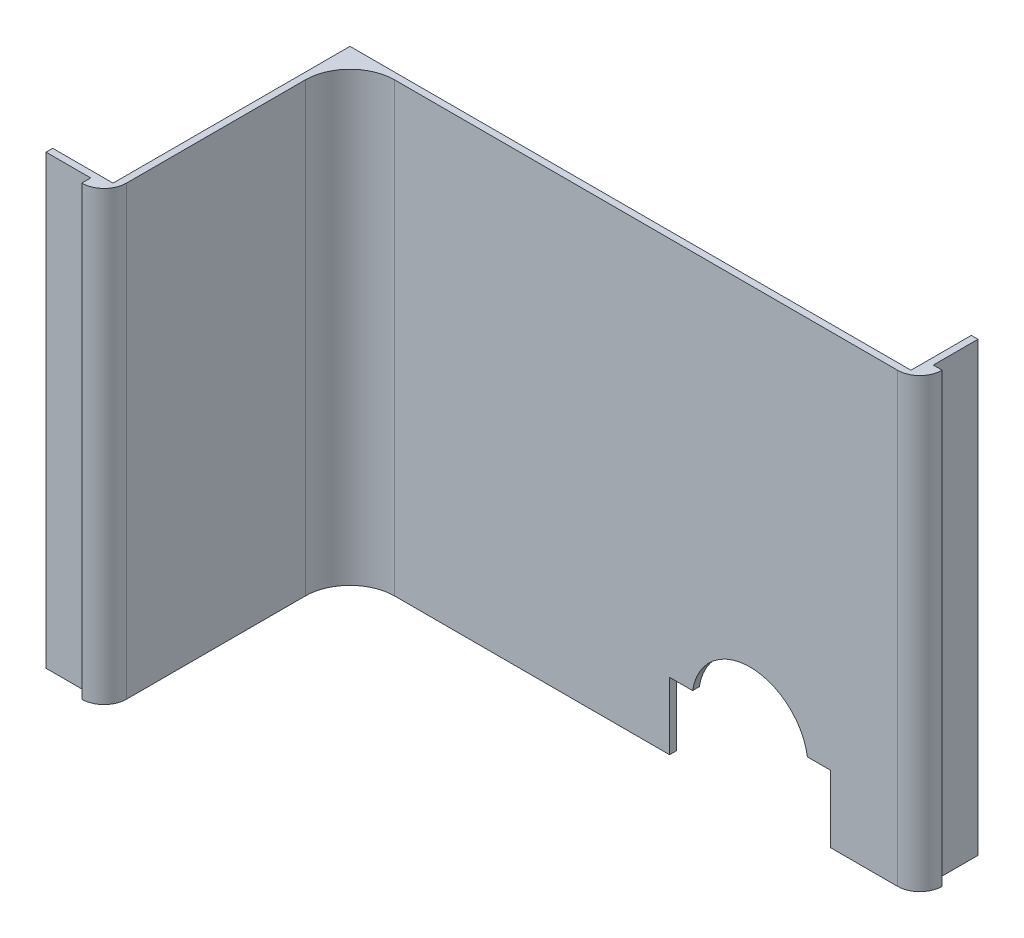
ISO-10303-21;
HEADER;
FILE_DESCRIPTION(('STEP AP214'),'2;1');
FILE_NAME('part.step','',(''),(''),'','','');
FILE_SCHEMA(('AUTOMOTIVE_DESIGN { 1 0 10303 214 1 1 1 1 }'));
ENDSEC;
DATA;
#1=APPLICATION_CONTEXT('core data for automotive mechanical design processes');
#2=APPLICATION_PROTOCOL_DEFINITION('international standard','automotive_design',2000,#1);
#3=PRODUCT_CONTEXT('',#1,'mechanical');
#4=PRODUCT('Part','Part','',(#3));
#5=PRODUCT_RELATED_PRODUCT_CATEGORY('part','',(#4));
#6=PRODUCT_DEFINITION_FORMATION('','',#4);
#7=PRODUCT_DEFINITION_CONTEXT('part definition',#1,'design');
#8=PRODUCT_DEFINITION('design','',#6,#7);
#9=PRODUCT_DEFINITION_SHAPE('','',#8);
#10=(LENGTH_UNIT() NAMED_UNIT(*) SI_UNIT(.MILLI.,.METRE.));
#11=(NAMED_UNIT(*) PLANE_ANGLE_UNIT() SI_UNIT($,.RADIAN.));
#12=(NAMED_UNIT(*) SI_UNIT($,.STERADIAN.) SOLID_ANGLE_UNIT());
#13=UNCERTAINTY_MEASURE_WITH_UNIT(LENGTH_MEASURE(1.E-05),#10,'distance_accuracy_value','');
#14=(GEOMETRIC_REPRESENTATION_CONTEXT(3) GLOBAL_UNCERTAINTY_ASSIGNED_CONTEXT((#13)) GLOBAL_UNIT_ASSIGNED_CONTEXT((#10,
#11,#12)) REPRESENTATION_CONTEXT('',''));
#15=CARTESIAN_POINT('',(0.,0.,0.));
#16=DIRECTION('',(0.,0.,1.));
#17=DIRECTION('',(1.,0.,0.));
#18=AXIS2_PLACEMENT_3D('',#15,#16,#17);
#19=CARTESIAN_POINT('',(0.,0.,-5.));
#20=DIRECTION('',(0.,1.,0.));
#21=DIRECTION('',(0.,0.,1.));
#22=AXIS2_PLACEMENT_3D('',#19,#20,#21);
#23=PLANE('',#22);
#24=DIRECTION('',(1.,0.,0.));
#25=VECTOR('',#24,1.);
#26=CARTESIAN_POINT('',(0.,0.,0.));
#27=LINE('',#26,#25);
#28=CARTESIAN_POINT('',(-15.,0.,0.));
#29=VERTEX_POINT('',#28);
#30=CARTESIAN_POINT('',(0.,0.,0.));
#31=VERTEX_POINT('',#30);
#32=EDGE_CURVE('E112',#29,#31,#27,.T.);
#33=ORIENTED_EDGE('',*,*,#32,.F.);
#34=DIRECTION('',(0.,0.,-1.));
#35=VECTOR('',#34,1.);
#36=CARTESIAN_POINT('',(-15.,0.,-5.));
#37=LINE('',#36,#35);
#38=CARTESIAN_POINT('',(-15.,0.,-1.5));
#39=VERTEX_POINT('',#38);
#40=EDGE_CURVE('E11',#29,#39,#37,.T.);
#41=ORIENTED_EDGE('',*,*,#40,.T.);
#42=DIRECTION('',(-1.,0.,0.));
#43=VECTOR('',#42,1.);
#44=CARTESIAN_POINT('',(-124.,0.,-1.49999999999999));
#45=LINE('',#44,#43);
#46=CARTESIAN_POINT('',(1.5,0.,-1.5));
#47=VERTEX_POINT('',#46);
#48=EDGE_CURVE('E199',#47,#39,#45,.T.);
#49=ORIENTED_EDGE('',*,*,#48,.F.);
#50=DIRECTION('',(0.,0.,1.));
#51=VECTOR('',#50,1.);
#52=CARTESIAN_POINT('',(1.5,0.,-15.));
#53=LINE('',#52,#51);
#54=CARTESIAN_POINT('',(1.5,0.,-15.));
#55=VERTEX_POINT('',#54);
#56=EDGE_CURVE('E196',#55,#47,#53,.T.);
#57=ORIENTED_EDGE('',*,*,#56,.F.);
#58=DIRECTION('',(-1.,0.,0.));
#59=VECTOR('',#58,1.);
#60=CARTESIAN_POINT('',(3.,0.,-15.));
#61=LINE('',#60,#59);
#62=CARTESIAN_POINT('',(3.,0.,-15.));
#63=VERTEX_POINT('',#62);
#64=EDGE_CURVE('E194',#63,#55,#61,.T.);
#65=ORIENTED_EDGE('',*,*,#64,.F.);
#66=DIRECTION('',(0.,0.,-1.));
#67=VECTOR('',#66,1.);
#68=CARTESIAN_POINT('',(3.,0.,-5.));
#69=LINE('',#68,#67);
#70=CARTESIAN_POINT('',(3.,0.,-5.));
#71=VERTEX_POINT('',#70);
#72=EDGE_CURVE('E192',#71,#63,#69,.T.);
#73=ORIENTED_EDGE('',*,*,#72,.F.);
#74=DIRECTION('',(-1.,0.,0.));
#75=VECTOR('',#74,1.);
#76=CARTESIAN_POINT('',(5.,0.,-5.));
#77=LINE('',#76,#75);
#78=CARTESIAN_POINT('',(5.,0.,-5.));
#79=VERTEX_POINT('',#78);
#80=EDGE_CURVE('E189',#79,#71,#77,.T.);
#81=ORIENTED_EDGE('',*,*,#80,.F.);
#82=CARTESIAN_POINT('',(0.,0.,-5.));
#83=DIRECTION('',(0.,1.,0.));
#84=DIRECTION('',(0.,0.,1.));
#85=AXIS2_PLACEMENT_3D('',#82,#83,#84);
#86=CIRCLE('',#85,5.);
#87=EDGE_CURVE('E186',#31,#79,#86,.T.);
#88=ORIENTED_EDGE('',*,*,#87,.F.);
#89=EDGE_LOOP('',(#33,#41,#49,#57,#65,#73,#81,#88));
#90=FACE_BOUND('',#89,.T.);
#91=ADVANCED_FACE('F34',(#90),#23,.F.);
#92=CARTESIAN_POINT('',(0.,100.,-5.));
#93=DIRECTION('',(0.,-1.,0.));
#94=DIRECTION('',(0.,0.,-1.));
#95=AXIS2_PLACEMENT_3D('',#92,#93,#94);
#96=CYLINDRICAL_SURFACE('',#95,5.);
#97=ORIENTED_EDGE('',*,*,#87,.T.);
#98=DIRECTION('',(0.,-1.,0.));
#99=VECTOR('',#98,1.);
#100=CARTESIAN_POINT('',(5.,100.,-5.));
#101=LINE('',#100,#99);
#102=CARTESIAN_POINT('',(5.,100.,-5.));
#103=VERTEX_POINT('',#102);
#104=EDGE_CURVE('E254',#103,#79,#101,.T.);
#105=ORIENTED_EDGE('',*,*,#104,.F.);
#106=CARTESIAN_POINT('',(0.,100.,-5.));
#107=DIRECTION('',(0.,1.,0.));
#108=DIRECTION('',(0.,0.,1.));
#109=AXIS2_PLACEMENT_3D('',#106,#107,#108);
#110=CIRCLE('',#109,5.);
#111=CARTESIAN_POINT('',(0.,100.,0.));
#112=VERTEX_POINT('',#111);
#113=EDGE_CURVE('E220',#112,#103,#110,.T.);
#114=ORIENTED_EDGE('',*,*,#113,.F.);
#115=DIRECTION('',(0.,-1.,0.));
#116=VECTOR('',#115,1.);
#117=CARTESIAN_POINT('',(0.,100.,0.));
#118=LINE('',#117,#116);
#119=EDGE_CURVE('E182',#112,#31,#118,.T.);
#120=ORIENTED_EDGE('',*,*,#119,.T.);
#121=EDGE_LOOP('',(#97,#105,#114,#120));
#122=FACE_BOUND('',#121,.T.);
#123=ADVANCED_FACE('F36',(#122),#96,.T.);
#124=CARTESIAN_POINT('',(5.,100.,-5.));
#125=DIRECTION('',(0.,0.,1.));
#126=DIRECTION('',(1.,0.,0.));
#127=AXIS2_PLACEMENT_3D('',#124,#125,#126);
#128=PLANE('',#127);
#129=ORIENTED_EDGE('',*,*,#80,.T.);
#130=DIRECTION('',(0.,-1.,0.));
#131=VECTOR('',#130,1.);
#132=CARTESIAN_POINT('',(3.,100.,-5.));
#133=LINE('',#132,#131);
#134=CARTESIAN_POINT('',(3.,100.,-5.));
#135=VERTEX_POINT('',#134);
#136=EDGE_CURVE('E251',#135,#71,#133,.T.);
#137=ORIENTED_EDGE('',*,*,#136,.F.);
#138=DIRECTION('',(-1.,0.,0.));
#139=VECTOR('',#138,1.);
#140=CARTESIAN_POINT('',(5.,100.,-5.));
#141=LINE('',#140,#139);
#142=EDGE_CURVE('E121',#103,#135,#141,.T.);
#143=ORIENTED_EDGE('',*,*,#142,.F.);
#144=ORIENTED_EDGE('',*,*,#104,.T.);
#145=EDGE_LOOP('',(#129,#137,#143,#144));
#146=FACE_BOUND('',#145,.T.);
#147=ADVANCED_FACE('F410',(#146),#128,.F.);
#148=CARTESIAN_POINT('',(3.,100.,-5.));
#149=DIRECTION('',(-1.,0.,0.));
#150=DIRECTION('',(0.,0.,1.));
#151=AXIS2_PLACEMENT_3D('',#148,#149,#150);
#152=PLANE('',#151);
#153=ORIENTED_EDGE('',*,*,#72,.T.);
#154=DIRECTION('',(0.,-1.,0.));
#155=VECTOR('',#154,1.);
#156=CARTESIAN_POINT('',(3.,100.,-15.));
#157=LINE('',#156,#155);
#158=CARTESIAN_POINT('',(3.,100.,-15.));
#159=VERTEX_POINT('',#158);
#160=EDGE_CURVE('E248',#159,#63,#157,.T.);
#161=ORIENTED_EDGE('',*,*,#160,.F.);
#162=DIRECTION('',(0.,0.,-1.));
#163=VECTOR('',#162,1.);
#164=CARTESIAN_POINT('',(3.,100.,-5.));
#165=LINE('',#164,#163);
#166=EDGE_CURVE('E272',#135,#159,#165,.T.);
#167=ORIENTED_EDGE('',*,*,#166,.F.);
#168=ORIENTED_EDGE('',*,*,#136,.T.);
#169=EDGE_LOOP('',(#153,#161,#167,#168));
#170=FACE_BOUND('',#169,.T.);
#171=ADVANCED_FACE('F409',(#170),#152,.F.);
#172=CARTESIAN_POINT('',(3.,100.,-15.));
#173=DIRECTION('',(0.,0.,1.));
#174=DIRECTION('',(1.,0.,0.));
#175=AXIS2_PLACEMENT_3D('',#172,#173,#174);
#176=PLANE('',#175);
#177=ORIENTED_EDGE('',*,*,#64,.T.);
#178=DIRECTION('',(0.,-1.,0.));
#179=VECTOR('',#178,1.);
#180=CARTESIAN_POINT('',(1.5,100.,-15.));
#181=LINE('',#180,#179);
#182=CARTESIAN_POINT('',(1.5,100.,-15.));
#183=VERTEX_POINT('',#182);
#184=EDGE_CURVE('E245',#183,#55,#181,.T.);
#185=ORIENTED_EDGE('',*,*,#184,.F.);
#186=DIRECTION('',(-1.,0.,0.));
#187=VECTOR('',#186,1.);
#188=CARTESIAN_POINT('',(3.,100.,-15.));
#189=LINE('',#188,#187);
#190=EDGE_CURVE('E278',#159,#183,#189,.T.);
#191=ORIENTED_EDGE('',*,*,#190,.F.);
#192=ORIENTED_EDGE('',*,*,#160,.T.);
#193=EDGE_LOOP('',(#177,#185,#191,#192));
#194=FACE_BOUND('',#193,.T.);
#195=ADVANCED_FACE('F404',(#194),#176,.F.);
#196=CARTESIAN_POINT('',(1.5,100.,-15.));
#197=DIRECTION('',(1.,0.,0.));
#198=DIRECTION('',(0.,0.,-1.));
#199=AXIS2_PLACEMENT_3D('',#196,#197,#198);
#200=PLANE('',#199);
#201=ORIENTED_EDGE('',*,*,#56,.T.);
#202=DIRECTION('',(0.,-1.,0.));
#203=VECTOR('',#202,1.);
#204=CARTESIAN_POINT('',(1.5,100.,-1.5));
#205=LINE('',#204,#203);
#206=CARTESIAN_POINT('',(1.5,100.,-1.5));
#207=VERTEX_POINT('',#206);
#208=EDGE_CURVE('E242',#207,#47,#205,.T.);
#209=ORIENTED_EDGE('',*,*,#208,.F.);
#210=DIRECTION('',(0.,0.,1.));
#211=VECTOR('',#210,1.);
#212=CARTESIAN_POINT('',(1.5,100.,-15.));
#213=LINE('',#212,#211);
#214=EDGE_CURVE('E280',#183,#207,#213,.T.);
#215=ORIENTED_EDGE('',*,*,#214,.F.);
#216=ORIENTED_EDGE('',*,*,#184,.T.);
#217=EDGE_LOOP('',(#201,#209,#215,#216));
#218=FACE_BOUND('',#217,.T.);
#219=ADVANCED_FACE('F399',(#218),#200,.F.);
#220=CARTESIAN_POINT('',(-124.,100.,-1.49999999999999));
#221=DIRECTION('',(0.,0.,1.));
#222=DIRECTION('',(1.,0.,0.));
#223=AXIS2_PLACEMENT_3D('',#220,#221,#222);
#224=PLANE('',#223);
#225=ORIENTED_EDGE('',*,*,#48,.T.);
#226=DIRECTION('',(0.,1.,0.));
#227=VECTOR('',#226,1.);
#228=CARTESIAN_POINT('',(-15.,100.,-1.5));
#229=LINE('',#228,#227);
#230=CARTESIAN_POINT('',(-15.,14.9971928806068,-1.5));
#231=VERTEX_POINT('',#230);
#232=EDGE_CURVE('E332',#39,#231,#229,.T.);
#233=ORIENTED_EDGE('',*,*,#232,.T.);
#234=DIRECTION('',(-1.,0.,0.));
#235=VECTOR('',#234,1.);
#236=CARTESIAN_POINT('',(-124.,14.9971928806068,-1.49999999999999));
#237=LINE('',#236,#235);
#238=CARTESIAN_POINT('',(-20.1543306675886,14.9971928806068,-1.5));
#239=VERTEX_POINT('',#238);
#240=EDGE_CURVE('E336',#231,#239,#237,.T.);
#241=ORIENTED_EDGE('',*,*,#240,.T.);
#242=CARTESIAN_POINT('',(-33.,13.,-1.5));
#243=DIRECTION('',(0.,0.,1.));
#244=DIRECTION('',(1.,0.,0.));
#245=AXIS2_PLACEMENT_3D('',#242,#243,#244);
#246=CIRCLE('',#245,13.);
#247=CARTESIAN_POINT('',(-45.8452325786651,15.,-1.5));
#248=VERTEX_POINT('',#247);
#249=EDGE_CURVE('E345',#239,#248,#246,.T.);
#250=ORIENTED_EDGE('',*,*,#249,.T.);
#251=DIRECTION('',(-1.,0.,0.));
#252=VECTOR('',#251,1.);
#253=CARTESIAN_POINT('',(-124.,15.,-1.49999999999999));
#254=LINE('',#253,#252);
#255=CARTESIAN_POINT('',(-51.,15.,-1.5));
#256=VERTEX_POINT('',#255);
#257=EDGE_CURVE('E190',#248,#256,#254,.T.);
#258=ORIENTED_EDGE('',*,*,#257,.T.);
#259=DIRECTION('',(0.,-1.,0.));
#260=VECTOR('',#259,1.);
#261=CARTESIAN_POINT('',(-51.,100.,-1.5));
#262=LINE('',#261,#260);
#263=CARTESIAN_POINT('',(-51.,0.,-1.5));
#264=VERTEX_POINT('',#263);
#265=EDGE_CURVE('E325',#256,#264,#262,.T.);
#266=ORIENTED_EDGE('',*,*,#265,.T.);
#267=CARTESIAN_POINT('',(-124.,0.,-1.49999999999999));
#268=VERTEX_POINT('',#267);
#269=EDGE_CURVE('E198',#264,#268,#45,.T.);
#270=ORIENTED_EDGE('',*,*,#269,.T.);
#271=DIRECTION('',(0.,-1.,0.));
#272=VECTOR('',#271,1.);
#273=CARTESIAN_POINT('',(-124.,100.,-1.49999999999999));
#274=LINE('',#273,#272);
#275=CARTESIAN_POINT('',(-124.,100.,-1.49999999999999));
#276=VERTEX_POINT('',#275);
#277=EDGE_CURVE('E239',#276,#268,#274,.T.);
#278=ORIENTED_EDGE('',*,*,#277,.F.);
#279=DIRECTION('',(-1.,0.,0.));
#280=VECTOR('',#279,1.);
#281=CARTESIAN_POINT('',(-124.,100.,-1.49999999999999));
#282=LINE('',#281,#280);
#283=EDGE_CURVE('E282',#207,#276,#282,.T.);
#284=ORIENTED_EDGE('',*,*,#283,.F.);
#285=ORIENTED_EDGE('',*,*,#208,.T.);
#286=EDGE_LOOP('',(#225,#233,#241,#250,#258,#266,#270,#278,#284,#285));
#287=FACE_BOUND('',#286,.T.);
#288=ADVANCED_FACE('F323',(#287),#224,.F.);
#289=CARTESIAN_POINT('',(-124.,100.,51.5));
#290=DIRECTION('',(1.,0.,0.));
#291=DIRECTION('',(0.,0.,-1.));
#292=AXIS2_PLACEMENT_3D('',#289,#290,#291);
#293=PLANE('',#292);
#294=DIRECTION('',(0.,0.,1.));
#295=VECTOR('',#294,1.);
#296=CARTESIAN_POINT('',(-124.,0.,51.5));
#297=LINE('',#296,#295);
#298=CARTESIAN_POINT('',(-124.,0.,51.5));
#299=VERTEX_POINT('',#298);
#300=EDGE_CURVE('E202',#268,#299,#297,.T.);
#301=ORIENTED_EDGE('',*,*,#300,.T.);
#302=DIRECTION('',(0.,-1.,0.));
#303=VECTOR('',#302,1.);
#304=CARTESIAN_POINT('',(-124.,100.,51.5));
#305=LINE('',#304,#303);
#306=CARTESIAN_POINT('',(-124.,100.,51.5));
#307=VERTEX_POINT('',#306);
#308=EDGE_CURVE('E236',#307,#299,#305,.T.);
#309=ORIENTED_EDGE('',*,*,#308,.F.);
#310=DIRECTION('',(0.,0.,1.));
#311=VECTOR('',#310,1.);
#312=CARTESIAN_POINT('',(-124.,100.,51.5));
#313=LINE('',#312,#311);
#314=EDGE_CURVE('E284',#276,#307,#313,.T.);
#315=ORIENTED_EDGE('',*,*,#314,.F.);
#316=ORIENTED_EDGE('',*,*,#277,.T.);
#317=EDGE_LOOP('',(#301,#309,#315,#316));
#318=FACE_BOUND('',#317,.T.);
#319=ADVANCED_FACE('F318',(#318),#293,.F.);
#320=CARTESIAN_POINT('',(-137.5,100.,51.5));
#321=DIRECTION('',(0.,0.,1.));
#322=DIRECTION('',(1.,0.,0.));
#323=AXIS2_PLACEMENT_3D('',#320,#321,#322);
#324=PLANE('',#323);
#325=DIRECTION('',(-1.,0.,0.));
#326=VECTOR('',#325,1.);
#327=CARTESIAN_POINT('',(-137.5,0.,51.5));
#328=LINE('',#327,#326);
#329=CARTESIAN_POINT('',(-137.5,0.,51.5));
#330=VERTEX_POINT('',#329);
#331=EDGE_CURVE('E204',#299,#330,#328,.T.);
#332=ORIENTED_EDGE('',*,*,#331,.T.);
#333=DIRECTION('',(0.,-1.,0.));
#334=VECTOR('',#333,1.);
#335=CARTESIAN_POINT('',(-137.5,100.,51.5));
#336=LINE('',#335,#334);
#337=CARTESIAN_POINT('',(-137.5,100.,51.5));
#338=VERTEX_POINT('',#337);
#339=EDGE_CURVE('E233',#338,#330,#336,.T.);
#340=ORIENTED_EDGE('',*,*,#339,.F.);
#341=DIRECTION('',(-1.,0.,0.));
#342=VECTOR('',#341,1.);
#343=CARTESIAN_POINT('',(-137.5,100.,51.5));
#344=LINE('',#343,#342);
#345=EDGE_CURVE('E286',#307,#338,#344,.T.);
#346=ORIENTED_EDGE('',*,*,#345,.F.);
#347=ORIENTED_EDGE('',*,*,#308,.T.);
#348=EDGE_LOOP('',(#332,#340,#346,#347));
#349=FACE_BOUND('',#348,.T.);
#350=ADVANCED_FACE('F315',(#349),#324,.F.);
#351=CARTESIAN_POINT('',(-137.5,100.,53.));
#352=DIRECTION('',(1.,0.,0.));
#353=DIRECTION('',(0.,0.,-1.));
#354=AXIS2_PLACEMENT_3D('',#351,#352,#353);
#355=PLANE('',#354);
#356=DIRECTION('',(0.,0.,1.));
#357=VECTOR('',#356,1.);
#358=CARTESIAN_POINT('',(-137.5,0.,53.));
#359=LINE('',#358,#357);
#360=CARTESIAN_POINT('',(-137.5,0.,53.));
#361=VERTEX_POINT('',#360);
#362=EDGE_CURVE('E206',#330,#361,#359,.T.);
#363=ORIENTED_EDGE('',*,*,#362,.T.);
#364=DIRECTION('',(0.,-1.,0.));
#365=VECTOR('',#364,1.);
#366=CARTESIAN_POINT('',(-137.5,100.,53.));
#367=LINE('',#366,#365);
#368=CARTESIAN_POINT('',(-137.5,100.,53.));
#369=VERTEX_POINT('',#368);
#370=EDGE_CURVE('E230',#369,#361,#367,.T.);
#371=ORIENTED_EDGE('',*,*,#370,.F.);
#372=DIRECTION('',(0.,0.,1.));
#373=VECTOR('',#372,1.);
#374=CARTESIAN_POINT('',(-137.5,100.,53.));
#375=LINE('',#374,#373);
#376=EDGE_CURVE('E288',#338,#369,#375,.T.);
#377=ORIENTED_EDGE('',*,*,#376,.F.);
#378=ORIENTED_EDGE('',*,*,#339,.T.);
#379=EDGE_LOOP('',(#363,#371,#377,#378));
#380=FACE_BOUND('',#379,.T.);
#381=ADVANCED_FACE('F311',(#380),#355,.F.);
#382=CARTESIAN_POINT('',(-127.5,100.,53.));
#383=DIRECTION('',(0.,0.,-1.));
#384=DIRECTION('',(-1.,0.,0.));
#385=AXIS2_PLACEMENT_3D('',#382,#383,#384);
#386=PLANE('',#385);
#387=DIRECTION('',(1.,0.,0.));
#388=VECTOR('',#387,1.);
#389=CARTESIAN_POINT('',(-127.5,0.,53.));
#390=LINE('',#389,#388);
#391=CARTESIAN_POINT('',(-127.5,0.,53.));
#392=VERTEX_POINT('',#391);
#393=EDGE_CURVE('E208',#361,#392,#390,.T.);
#394=ORIENTED_EDGE('',*,*,#393,.T.);
#395=DIRECTION('',(0.,-1.,0.));
#396=VECTOR('',#395,1.);
#397=CARTESIAN_POINT('',(-127.5,100.,53.));
#398=LINE('',#397,#396);
#399=CARTESIAN_POINT('',(-127.5,100.,53.));
#400=VERTEX_POINT('',#399);
#401=EDGE_CURVE('E227',#400,#392,#398,.T.);
#402=ORIENTED_EDGE('',*,*,#401,.F.);
#403=DIRECTION('',(1.,0.,0.));
#404=VECTOR('',#403,1.);
#405=CARTESIAN_POINT('',(-127.5,100.,53.));
#406=LINE('',#405,#404);
#407=EDGE_CURVE('E290',#369,#400,#406,.T.);
#408=ORIENTED_EDGE('',*,*,#407,.F.);
#409=ORIENTED_EDGE('',*,*,#370,.T.);
#410=EDGE_LOOP('',(#394,#402,#408,#409));
#411=FACE_BOUND('',#410,.T.);
#412=ADVANCED_FACE('F307',(#411),#386,.F.);
#413=CARTESIAN_POINT('',(-127.5,100.,55.));
#414=DIRECTION('',(1.,0.,0.));
#415=DIRECTION('',(0.,0.,-1.));
#416=AXIS2_PLACEMENT_3D('',#413,#414,#415);
#417=PLANE('',#416);
#418=DIRECTION('',(0.,0.,1.));
#419=VECTOR('',#418,1.);
#420=CARTESIAN_POINT('',(-127.5,0.,55.));
#421=LINE('',#420,#419);
#422=CARTESIAN_POINT('',(-127.5,0.,55.));
#423=VERTEX_POINT('',#422);
#424=EDGE_CURVE('E210',#392,#423,#421,.T.);
#425=ORIENTED_EDGE('',*,*,#424,.T.);
#426=DIRECTION('',(0.,-1.,0.));
#427=VECTOR('',#426,1.);
#428=CARTESIAN_POINT('',(-127.5,100.,55.));
#429=LINE('',#428,#427);
#430=CARTESIAN_POINT('',(-127.5,100.,55.));
#431=VERTEX_POINT('',#430);
#432=EDGE_CURVE('E224',#431,#423,#429,.T.);
#433=ORIENTED_EDGE('',*,*,#432,.F.);
#434=DIRECTION('',(0.,0.,1.));
#435=VECTOR('',#434,1.);
#436=CARTESIAN_POINT('',(-127.5,100.,55.));
#437=LINE('',#436,#435);
#438=EDGE_CURVE('E292',#400,#431,#437,.T.);
#439=ORIENTED_EDGE('',*,*,#438,.F.);
#440=ORIENTED_EDGE('',*,*,#401,.T.);
#441=EDGE_LOOP('',(#425,#433,#439,#440));
#442=FACE_BOUND('',#441,.T.);
#443=ADVANCED_FACE('F298',(#442),#417,.F.);
#444=CARTESIAN_POINT('',(-127.5,100.,50.));
#445=DIRECTION('',(0.,-1.,0.));
#446=DIRECTION('',(0.,0.,-1.));
#447=AXIS2_PLACEMENT_3D('',#444,#445,#446);
#448=CYLINDRICAL_SURFACE('',#447,5.00000000000001);
#449=CARTESIAN_POINT('',(-127.5,0.,50.));
#450=DIRECTION('',(0.,1.,0.));
#451=DIRECTION('',(0.,0.,-1.));
#452=AXIS2_PLACEMENT_3D('',#449,#450,#451);
#453=CIRCLE('',#452,5.00000000000001);
#454=CARTESIAN_POINT('',(-122.5,0.,50.));
#455=VERTEX_POINT('',#454);
#456=EDGE_CURVE('E212',#423,#455,#453,.T.);
#457=ORIENTED_EDGE('',*,*,#456,.T.);
#458=DIRECTION('',(0.,-1.,0.));
#459=VECTOR('',#458,1.);
#460=CARTESIAN_POINT('',(-122.5,100.,50.));
#461=LINE('',#460,#459);
#462=CARTESIAN_POINT('',(-122.5,100.,50.));
#463=VERTEX_POINT('',#462);
#464=EDGE_CURVE('E176',#463,#455,#461,.T.);
#465=ORIENTED_EDGE('',*,*,#464,.F.);
#466=CARTESIAN_POINT('',(-127.5,100.,50.));
#467=DIRECTION('',(0.,1.,0.));
#468=DIRECTION('',(0.,0.,-1.));
#469=AXIS2_PLACEMENT_3D('',#466,#467,#468);
#470=CIRCLE('',#469,5.00000000000001);
#471=EDGE_CURVE('E164',#431,#463,#470,.T.);
#472=ORIENTED_EDGE('',*,*,#471,.F.);
#473=ORIENTED_EDGE('',*,*,#432,.T.);
#474=EDGE_LOOP('',(#457,#465,#472,#473));
#475=FACE_BOUND('',#474,.T.);
#476=ADVANCED_FACE('F302',(#475),#448,.T.);
#477=CARTESIAN_POINT('',(-122.5,100.,10.));
#478=DIRECTION('',(-1.,0.,0.));
#479=DIRECTION('',(0.,0.,1.));
#480=AXIS2_PLACEMENT_3D('',#477,#478,#479);
#481=PLANE('',#480);
#482=DIRECTION('',(0.,0.,-1.));
#483=VECTOR('',#482,1.);
#484=CARTESIAN_POINT('',(-122.5,0.,10.));
#485=LINE('',#484,#483);
#486=CARTESIAN_POINT('',(-122.5,0.,10.));
#487=VERTEX_POINT('',#486);
#488=EDGE_CURVE('E173',#455,#487,#485,.T.);
#489=ORIENTED_EDGE('',*,*,#488,.T.);
#490=DIRECTION('',(0.,-1.,0.));
#491=VECTOR('',#490,1.);
#492=CARTESIAN_POINT('',(-122.5,100.,10.));
#493=LINE('',#492,#491);
#494=CARTESIAN_POINT('',(-122.5,100.,10.));
#495=VERTEX_POINT('',#494);
#496=EDGE_CURVE('E170',#495,#487,#493,.T.);
#497=ORIENTED_EDGE('',*,*,#496,.F.);
#498=DIRECTION('',(0.,0.,-1.));
#499=VECTOR('',#498,1.);
#500=CARTESIAN_POINT('',(-122.5,100.,10.));
#501=LINE('',#500,#499);
#502=EDGE_CURVE('E157',#463,#495,#501,.T.);
#503=ORIENTED_EDGE('',*,*,#502,.F.);
#504=ORIENTED_EDGE('',*,*,#464,.T.);
#505=EDGE_LOOP('',(#489,#497,#503,#504));
#506=FACE_BOUND('',#505,.T.);
#507=ADVANCED_FACE('F171',(#506),#481,.F.);
#508=CARTESIAN_POINT('',(-112.5,100.,10.));
#509=DIRECTION('',(0.,-1.,0.));
#510=DIRECTION('',(0.,0.,-1.));
#511=AXIS2_PLACEMENT_3D('',#508,#509,#510);
#512=CYLINDRICAL_SURFACE('',#511,9.99999999999999);
#513=CARTESIAN_POINT('',(-112.5,0.,10.));
#514=DIRECTION('',(0.,-1.,0.));
#515=DIRECTION('',(0.,0.,1.));
#516=AXIS2_PLACEMENT_3D('',#513,#514,#515);
#517=CIRCLE('',#516,9.99999999999999);
#518=CARTESIAN_POINT('',(-112.5,0.,0.));
#519=VERTEX_POINT('',#518);
#520=EDGE_CURVE('E215',#487,#519,#517,.T.);
#521=ORIENTED_EDGE('',*,*,#520,.T.);
#522=DIRECTION('',(0.,-1.,0.));
#523=VECTOR('',#522,1.);
#524=CARTESIAN_POINT('',(-112.5,100.,0.));
#525=LINE('',#524,#523);
#526=CARTESIAN_POINT('',(-112.5,100.,0.));
#527=VERTEX_POINT('',#526);
#528=EDGE_CURVE('E177',#527,#519,#525,.T.);
#529=ORIENTED_EDGE('',*,*,#528,.F.);
#530=CARTESIAN_POINT('',(-112.5,100.,10.));
#531=DIRECTION('',(0.,-1.,0.));
#532=DIRECTION('',(0.,0.,1.));
#533=AXIS2_PLACEMENT_3D('',#530,#531,#532);
#534=CIRCLE('',#533,9.99999999999999);
#535=EDGE_CURVE('E161',#495,#527,#534,.T.);
#536=ORIENTED_EDGE('',*,*,#535,.F.);
#537=ORIENTED_EDGE('',*,*,#496,.T.);
#538=EDGE_LOOP('',(#521,#529,#536,#537));
#539=FACE_BOUND('',#538,.T.);
#540=ADVANCED_FACE('F179',(#539),#512,.F.);
#541=CARTESIAN_POINT('',(0.,100.,0.));
#542=DIRECTION('',(0.,0.,-1.));
#543=DIRECTION('',(-1.,0.,0.));
#544=AXIS2_PLACEMENT_3D('',#541,#542,#543);
#545=PLANE('',#544);
#546=DIRECTION('',(-1.,0.,0.));
#547=VECTOR('',#546,1.);
#548=CARTESIAN_POINT('',(-15.,14.9971928806068,0.));
#549=LINE('',#548,#547);
#550=CARTESIAN_POINT('',(-15.,14.9971928806068,0.));
#551=VERTEX_POINT('',#550);
#552=CARTESIAN_POINT('',(-20.1543306675886,14.9971928806068,0.));
#553=VERTEX_POINT('',#552);
#554=EDGE_CURVE('E364',#551,#553,#549,.T.);
#555=ORIENTED_EDGE('',*,*,#554,.F.);
#556=DIRECTION('',(0.,1.,0.));
#557=VECTOR('',#556,1.);
#558=CARTESIAN_POINT('',(-15.,0.,0.));
#559=LINE('',#558,#557);
#560=EDGE_CURVE('E375',#29,#551,#559,.T.);
#561=ORIENTED_EDGE('',*,*,#560,.F.);
#562=ORIENTED_EDGE('',*,*,#32,.T.);
#563=ORIENTED_EDGE('',*,*,#119,.F.);
#564=DIRECTION('',(1.,0.,0.));
#565=VECTOR('',#564,1.);
#566=CARTESIAN_POINT('',(0.,100.,0.));
#567=LINE('',#566,#565);
#568=EDGE_CURVE('E58',#527,#112,#567,.T.);
#569=ORIENTED_EDGE('',*,*,#568,.F.);
#570=ORIENTED_EDGE('',*,*,#528,.T.);
#571=CARTESIAN_POINT('',(-51.,0.,0.));
#572=VERTEX_POINT('',#571);
#573=EDGE_CURVE('E217',#519,#572,#27,.T.);
#574=ORIENTED_EDGE('',*,*,#573,.T.);
#575=DIRECTION('',(0.,-1.,0.));
#576=VECTOR('',#575,1.);
#577=CARTESIAN_POINT('',(-51.,0.,0.));
#578=LINE('',#577,#576);
#579=CARTESIAN_POINT('',(-51.,15.,0.));
#580=VERTEX_POINT('',#579);
#581=EDGE_CURVE('E49',#580,#572,#578,.T.);
#582=ORIENTED_EDGE('',*,*,#581,.F.);
#583=DIRECTION('',(-1.,0.,0.));
#584=VECTOR('',#583,1.);
#585=CARTESIAN_POINT('',(-51.,15.,0.));
#586=LINE('',#585,#584);
#587=CARTESIAN_POINT('',(-45.8452325786651,15.,0.));
#588=VERTEX_POINT('',#587);
#589=EDGE_CURVE('E369',#588,#580,#586,.T.);
#590=ORIENTED_EDGE('',*,*,#589,.F.);
#591=CARTESIAN_POINT('',(-33.,13.,0.));
#592=DIRECTION('',(0.,0.,1.));
#593=DIRECTION('',(-1.,0.,0.));
#594=AXIS2_PLACEMENT_3D('',#591,#592,#593);
#595=CIRCLE('',#594,13.);
#596=EDGE_CURVE('E372',#553,#588,#595,.T.);
#597=ORIENTED_EDGE('',*,*,#596,.F.);
#598=EDGE_LOOP('',(#555,#561,#562,#563,#569,#570,#574,#582,#590,#597));
#599=FACE_BOUND('',#598,.T.);
#600=ADVANCED_FACE('F264',(#599),#545,.F.);
#601=CARTESIAN_POINT('',(0.,100.,-5.));
#602=DIRECTION('',(0.,1.,0.));
#603=DIRECTION('',(0.,0.,1.));
#604=AXIS2_PLACEMENT_3D('',#601,#602,#603);
#605=PLANE('',#604);
#606=ORIENTED_EDGE('',*,*,#113,.T.);
#607=ORIENTED_EDGE('',*,*,#142,.T.);
#608=ORIENTED_EDGE('',*,*,#166,.T.);
#609=ORIENTED_EDGE('',*,*,#190,.T.);
#610=ORIENTED_EDGE('',*,*,#214,.T.);
#611=ORIENTED_EDGE('',*,*,#283,.T.);
#612=ORIENTED_EDGE('',*,*,#314,.T.);
#613=ORIENTED_EDGE('',*,*,#345,.T.);
#614=ORIENTED_EDGE('',*,*,#376,.T.);
#615=ORIENTED_EDGE('',*,*,#407,.T.);
#616=ORIENTED_EDGE('',*,*,#438,.T.);
#617=ORIENTED_EDGE('',*,*,#471,.T.);
#618=ORIENTED_EDGE('',*,*,#502,.T.);
#619=ORIENTED_EDGE('',*,*,#535,.T.);
#620=ORIENTED_EDGE('',*,*,#568,.T.);
#621=EDGE_LOOP('',(#606,#607,#608,#609,#610,#611,#612,#613,#614,#615,#616,#617,#618,#619,#620));
#622=FACE_BOUND('',#621,.T.);
#623=ADVANCED_FACE('F159',(#622),#605,.T.);
#624=ORIENTED_EDGE('',*,*,#269,.F.);
#625=DIRECTION('',(0.,0.,1.));
#626=VECTOR('',#625,1.);
#627=CARTESIAN_POINT('',(-51.,0.,-5.));
#628=LINE('',#627,#626);
#629=EDGE_CURVE('E42',#264,#572,#628,.T.);
#630=ORIENTED_EDGE('',*,*,#629,.T.);
#631=ORIENTED_EDGE('',*,*,#573,.F.);
#632=ORIENTED_EDGE('',*,*,#520,.F.);
#633=ORIENTED_EDGE('',*,*,#488,.F.);
#634=ORIENTED_EDGE('',*,*,#456,.F.);
#635=ORIENTED_EDGE('',*,*,#424,.F.);
#636=ORIENTED_EDGE('',*,*,#393,.F.);
#637=ORIENTED_EDGE('',*,*,#362,.F.);
#638=ORIENTED_EDGE('',*,*,#331,.F.);
#639=ORIENTED_EDGE('',*,*,#300,.F.);
#640=EDGE_LOOP('',(#624,#630,#631,#632,#633,#634,#635,#636,#637,#638,#639));
#641=FACE_BOUND('',#640,.T.);
#642=ADVANCED_FACE('F258',(#641),#23,.F.);
#643=CARTESIAN_POINT('',(-51.,15.,-15.));
#644=DIRECTION('',(0.,1.,0.));
#645=DIRECTION('',(0.,0.,1.));
#646=AXIS2_PLACEMENT_3D('',#643,#644,#645);
#647=PLANE('',#646);
#648=DIRECTION('',(0.,0.,1.));
#649=VECTOR('',#648,1.);
#650=CARTESIAN_POINT('',(-45.8452325786651,15.,-15.));
#651=LINE('',#650,#649);
#652=EDGE_CURVE('E338',#248,#588,#651,.T.);
#653=ORIENTED_EDGE('',*,*,#652,.T.);
#654=ORIENTED_EDGE('',*,*,#589,.T.);
#655=DIRECTION('',(0.,0.,1.));
#656=VECTOR('',#655,1.);
#657=CARTESIAN_POINT('',(-51.,15.,-15.));
#658=LINE('',#657,#656);
#659=EDGE_CURVE('E333',#256,#580,#658,.T.);
#660=ORIENTED_EDGE('',*,*,#659,.F.);
#661=ORIENTED_EDGE('',*,*,#257,.F.);
#662=EDGE_LOOP('',(#653,#654,#660,#661));
#663=FACE_BOUND('',#662,.T.);
#664=ADVANCED_FACE('F424',(#663),#647,.F.);
#665=CARTESIAN_POINT('',(-33.,13.,-15.));
#666=DIRECTION('',(0.,0.,1.));
#667=DIRECTION('',(1.,0.,0.));
#668=AXIS2_PLACEMENT_3D('',#665,#666,#667);
#669=CYLINDRICAL_SURFACE('',#668,13.);
#670=DIRECTION('',(0.,0.,1.));
#671=VECTOR('',#670,1.);
#672=CARTESIAN_POINT('',(-20.1543306675886,14.9971928806068,-15.));
#673=LINE('',#672,#671);
#674=EDGE_CURVE('E356',#239,#553,#673,.T.);
#675=ORIENTED_EDGE('',*,*,#674,.T.);
#676=ORIENTED_EDGE('',*,*,#596,.T.);
#677=ORIENTED_EDGE('',*,*,#652,.F.);
#678=ORIENTED_EDGE('',*,*,#249,.F.);
#679=EDGE_LOOP('',(#675,#676,#677,#678));
#680=FACE_BOUND('',#679,.T.);
#681=ADVANCED_FACE('F353',(#680),#669,.F.);
#682=CARTESIAN_POINT('',(-15.,14.9971928806068,-15.));
#683=DIRECTION('',(0.,1.,0.));
#684=DIRECTION('',(0.,0.,1.));
#685=AXIS2_PLACEMENT_3D('',#682,#683,#684);
#686=PLANE('',#685);
#687=DIRECTION('',(0.,0.,1.));
#688=VECTOR('',#687,1.);
#689=CARTESIAN_POINT('',(-15.,14.9971928806068,-15.));
#690=LINE('',#689,#688);
#691=EDGE_CURVE('E341',#231,#551,#690,.T.);
#692=ORIENTED_EDGE('',*,*,#691,.T.);
#693=ORIENTED_EDGE('',*,*,#554,.T.);
#694=ORIENTED_EDGE('',*,*,#674,.F.);
#695=ORIENTED_EDGE('',*,*,#240,.F.);
#696=EDGE_LOOP('',(#692,#693,#694,#695));
#697=FACE_BOUND('',#696,.T.);
#698=ADVANCED_FACE('F362',(#697),#686,.F.);
#699=CARTESIAN_POINT('',(-15.,0.,-15.));
#700=DIRECTION('',(1.,0.,0.));
#701=DIRECTION('',(0.,0.,-1.));
#702=AXIS2_PLACEMENT_3D('',#699,#700,#701);
#703=PLANE('',#702);
#704=ORIENTED_EDGE('',*,*,#40,.F.);
#705=ORIENTED_EDGE('',*,*,#560,.T.);
#706=ORIENTED_EDGE('',*,*,#691,.F.);
#707=ORIENTED_EDGE('',*,*,#232,.F.);
#708=EDGE_LOOP('',(#704,#705,#706,#707));
#709=FACE_BOUND('',#708,.T.);
#710=ADVANCED_FACE('F380',(#709),#703,.F.);
#711=CARTESIAN_POINT('',(-51.,0.,-15.));
#712=DIRECTION('',(-1.,0.,0.));
#713=DIRECTION('',(0.,0.,1.));
#714=AXIS2_PLACEMENT_3D('',#711,#712,#713);
#715=PLANE('',#714);
#716=ORIENTED_EDGE('',*,*,#659,.T.);
#717=ORIENTED_EDGE('',*,*,#581,.T.);
#718=ORIENTED_EDGE('',*,*,#629,.F.);
#719=ORIENTED_EDGE('',*,*,#265,.F.);
#720=EDGE_LOOP('',(#716,#717,#718,#719));
#721=FACE_BOUND('',#720,.T.);
#722=ADVANCED_FACE('F436',(#721),#715,.F.);
#723=CLOSED_SHELL('',(#91,#123,#147,#171,#195,#219,#288,#319,#350,#381,#412,#443,#476,#507,#540,
#600,#623,#642,#664,#681,#698,#710,#722));
#724=MANIFOLD_SOLID_BREP('B2',#723);
#725=ADVANCED_BREP_SHAPE_REPRESENTATION('',(#18,#724),#14);
#726=SHAPE_DEFINITION_REPRESENTATION(#9,#725);
ENDSEC;
END-ISO-10303-21;
